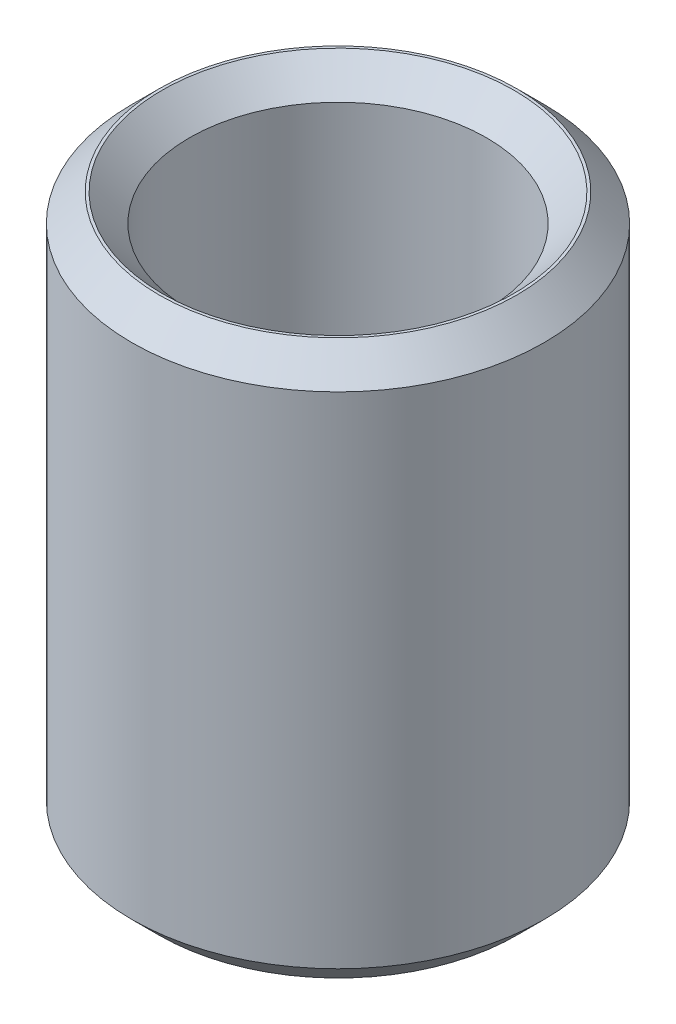
ISO-10303-21;
HEADER;
FILE_DESCRIPTION(('STEP AP214'),'2;1');
FILE_NAME('part.step','',(''),(''),'','','');
FILE_SCHEMA(('AUTOMOTIVE_DESIGN { 1 0 10303 214 1 1 1 1 }'));
ENDSEC;
DATA;
#1=APPLICATION_CONTEXT('core data for automotive mechanical design processes');
#2=APPLICATION_PROTOCOL_DEFINITION('international standard','automotive_design',2000,#1);
#3=PRODUCT_CONTEXT('',#1,'mechanical');
#4=PRODUCT('Part','Part','',(#3));
#5=PRODUCT_RELATED_PRODUCT_CATEGORY('part','',(#4));
#6=PRODUCT_DEFINITION_FORMATION('','',#4);
#7=PRODUCT_DEFINITION_CONTEXT('part definition',#1,'design');
#8=PRODUCT_DEFINITION('design','',#6,#7);
#9=PRODUCT_DEFINITION_SHAPE('','',#8);
#10=(LENGTH_UNIT() NAMED_UNIT(*) SI_UNIT(.MILLI.,.METRE.));
#11=(NAMED_UNIT(*) PLANE_ANGLE_UNIT() SI_UNIT($,.RADIAN.));
#12=(NAMED_UNIT(*) SI_UNIT($,.STERADIAN.) SOLID_ANGLE_UNIT());
#13=UNCERTAINTY_MEASURE_WITH_UNIT(LENGTH_MEASURE(1.E-05),#10,'distance_accuracy_value','');
#14=(GEOMETRIC_REPRESENTATION_CONTEXT(3) GLOBAL_UNCERTAINTY_ASSIGNED_CONTEXT((#13)) GLOBAL_UNIT_ASSIGNED_CONTEXT((#10,
#11,#12)) REPRESENTATION_CONTEXT('',''));
#15=CARTESIAN_POINT('',(0.,0.,0.));
#16=DIRECTION('',(0.,0.,1.));
#17=DIRECTION('',(1.,0.,0.));
#18=AXIS2_PLACEMENT_3D('',#15,#16,#17);
#19=CARTESIAN_POINT('',(0.,73.9349199069751,0.));
#20=DIRECTION('',(0.,-1.,0.));
#21=DIRECTION('',(0.,0.,-1.));
#22=AXIS2_PLACEMENT_3D('',#19,#20,#21);
#23=CYLINDRICAL_SURFACE('',#22,27.5);
#24=CARTESIAN_POINT('',(0.,3.65891610564793,0.));
#25=DIRECTION('',(0.,1.,0.));
#26=DIRECTION('',(0.,0.,1.));
#27=AXIS2_PLACEMENT_3D('',#24,#25,#26);
#28=CIRCLE('',#27,27.5);
#29=CARTESIAN_POINT('',(0.,3.65891610564793,-27.5));
#30=VERTEX_POINT('',#29);
#31=EDGE_CURVE('E10',#30,#30,#28,.T.);
#32=CARTESIAN_POINT('',(0.,70.2760038013273,0.));
#33=DIRECTION('',(0.,1.,0.));
#34=DIRECTION('',(0.,0.,1.));
#35=AXIS2_PLACEMENT_3D('',#32,#33,#34);
#36=CIRCLE('',#35,27.5);
#37=CARTESIAN_POINT('',(0.,70.2760038013273,-27.5));
#38=VERTEX_POINT('',#37);
#39=EDGE_CURVE('E50',#38,#38,#36,.F.);
#40=CARTESIAN_POINT('',(0.,3.65891610564793,-27.5));
#41=CARTESIAN_POINT('',(0.,4.35284410247793,-27.5));
#42=CARTESIAN_POINT('',(0.,5.04677209930792,-27.5));
#43=CARTESIAN_POINT('',(0.,6.43462809296791,-27.5));
#44=CARTESIAN_POINT('',(0.,7.1285560897979,-27.5));
#45=CARTESIAN_POINT('',(0.,8.51641208345788,-27.5));
#46=CARTESIAN_POINT('',(0.,9.21034008028788,-27.5));
#47=CARTESIAN_POINT('',(0.,10.5981960739479,-27.5));
#48=CARTESIAN_POINT('',(0.,11.2921240707779,-27.5));
#49=CARTESIAN_POINT('',(0.,12.6799800644378,-27.5));
#50=CARTESIAN_POINT('',(0.,13.3739080612678,-27.5));
#51=CARTESIAN_POINT('',(0.,14.7617640549278,-27.5));
#52=CARTESIAN_POINT('',(0.,15.4556920517578,-27.5));
#53=CARTESIAN_POINT('',(0.,16.8435480454178,-27.5));
#54=CARTESIAN_POINT('',(0.,17.5374760422478,-27.5));
#55=CARTESIAN_POINT('',(0.,18.9253320359078,-27.5));
#56=CARTESIAN_POINT('',(0.,19.6192600327378,-27.5));
#57=CARTESIAN_POINT('',(0.,21.0071160263978,-27.5));
#58=CARTESIAN_POINT('',(0.,21.7010440232277,-27.5));
#59=CARTESIAN_POINT('',(0.,23.0889000168877,-27.5));
#60=CARTESIAN_POINT('',(0.,23.7828280137177,-27.5));
#61=CARTESIAN_POINT('',(0.,25.1706840073777,-27.5));
#62=CARTESIAN_POINT('',(0.,25.8646120042077,-27.5));
#63=CARTESIAN_POINT('',(0.,27.2524679978677,-27.5));
#64=CARTESIAN_POINT('',(0.,27.9463959946977,-27.5));
#65=CARTESIAN_POINT('',(0.,29.3342519883577,-27.5));
#66=CARTESIAN_POINT('',(0.,30.0281799851877,-27.5));
#67=CARTESIAN_POINT('',(0.,31.4160359788477,-27.5));
#68=CARTESIAN_POINT('',(0.,32.1099639756777,-27.5));
#69=CARTESIAN_POINT('',(0.,33.4978199693376,-27.5));
#70=CARTESIAN_POINT('',(0.,34.1917479661676,-27.5));
#71=CARTESIAN_POINT('',(0.,35.5796039598276,-27.5));
#72=CARTESIAN_POINT('',(0.,36.2735319566576,-27.5));
#73=CARTESIAN_POINT('',(0.,37.6613879503176,-27.5));
#74=CARTESIAN_POINT('',(0.,38.3553159471476,-27.5));
#75=CARTESIAN_POINT('',(0.,39.7431719408076,-27.5));
#76=CARTESIAN_POINT('',(0.,40.4370999376376,-27.5));
#77=CARTESIAN_POINT('',(0.,41.8249559312976,-27.5));
#78=CARTESIAN_POINT('',(0.,42.5188839281276,-27.5));
#79=CARTESIAN_POINT('',(0.,43.9067399217875,-27.5));
#80=CARTESIAN_POINT('',(0.,44.6006679186175,-27.5));
#81=CARTESIAN_POINT('',(0.,45.9885239122775,-27.5));
#82=CARTESIAN_POINT('',(0.,46.6824519091075,-27.5));
#83=CARTESIAN_POINT('',(0.,48.0703079027675,-27.5));
#84=CARTESIAN_POINT('',(0.,48.7642358995975,-27.5));
#85=CARTESIAN_POINT('',(0.,50.1520918932575,-27.5));
#86=CARTESIAN_POINT('',(0.,50.8460198900875,-27.5));
#87=CARTESIAN_POINT('',(0.,52.2338758837475,-27.5));
#88=CARTESIAN_POINT('',(0.,52.9278038805774,-27.5));
#89=CARTESIAN_POINT('',(0.,54.3156598742374,-27.5));
#90=CARTESIAN_POINT('',(0.,55.0095878710674,-27.5));
#91=CARTESIAN_POINT('',(0.,56.3974438647274,-27.5));
#92=CARTESIAN_POINT('',(0.,57.0913718615574,-27.5));
#93=CARTESIAN_POINT('',(0.,58.4792278552174,-27.5));
#94=CARTESIAN_POINT('',(0.,59.1731558520474,-27.5));
#95=CARTESIAN_POINT('',(0.,60.5610118457074,-27.5));
#96=CARTESIAN_POINT('',(0.,61.2549398425374,-27.5));
#97=CARTESIAN_POINT('',(0.,62.6427958361974,-27.5));
#98=CARTESIAN_POINT('',(0.,63.3367238330273,-27.5));
#99=CARTESIAN_POINT('',(0.,64.7245798266873,-27.5));
#100=CARTESIAN_POINT('',(0.,65.4185078235173,-27.5));
#101=CARTESIAN_POINT('',(0.,66.8063638171773,-27.5));
#102=CARTESIAN_POINT('',(0.,67.5002918140073,-27.5));
#103=CARTESIAN_POINT('',(0.,68.8881478076673,-27.5));
#104=CARTESIAN_POINT('',(0.,69.5820758044973,-27.5));
#105=CARTESIAN_POINT('',(0.,70.2760038013273,-27.5));
#106=B_SPLINE_CURVE_WITH_KNOTS('',3,(#40,#41,#42,#43,#44,#45,#46,#47,#48,#49,#50,#51,#52,#53,
#54,#55,#56,#57,#58,#59,#60,#61,#62,#63,#64,#65,#66,#67,#68,#69,#70,#71,#72,#73,#74,#75,#76,#77,
#78,#79,#80,#81,#82,#83,#84,#85,#86,#87,#88,#89,#90,#91,#92,#93,#94,#95,#96,#97,#98,#99,#100,
#101,#102,#103,#104,#105),.UNSPECIFIED.,.F.,.F.,(4,2,2,2,2,2,2,2,2,2,2,2,2,2,2,2,2,2,2,2,2,2,2,
2,2,2,2,2,2,2,2,2,4),(0.,2.08178399048999,4.16356798097996,6.24535197146994,8.32713596195991,
10.4089199524499,12.4907039429399,14.5724879334298,16.6542719239198,18.7360559144098,
20.8178399048998,22.8996238953898,24.9814078858797,27.0631918763697,29.1449758668597,
31.2267598573497,33.3085438478397,35.3903278383296,37.4721118288196,39.5538958193096,
41.6356798097996,43.7174638002896,45.7992477907795,47.8810317812695,49.9628157717595,
52.0445997622495,54.1263837527395,56.2081677432294,58.2899517337194,60.3717357242094,
62.4535197146994,64.5353037051893,66.6170876956793),.UNSPECIFIED.);
#107=EDGE_CURVE('BSEAM39',#30,#38,#106,.T.);
#108=ORIENTED_EDGE('',*,*,#31,.T.);
#109=ORIENTED_EDGE('',*,*,#39,.T.);
#110=ORIENTED_EDGE('',*,*,#107,.T.);
#111=ORIENTED_EDGE('',*,*,#107,.F.);
#112=EDGE_LOOP('',(#108,#110,#109,#111));
#113=FACE_BOUND('',#112,.T.);
#114=ADVANCED_FACE('F39',(#113),#23,.T.);
#115=CARTESIAN_POINT('',(0.,73.9349199069751,0.));
#116=DIRECTION('',(0.,1.,0.));
#117=DIRECTION('',(0.,0.,1.));
#118=AXIS2_PLACEMENT_3D('',#115,#116,#117);
#119=PLANE('',#118);
#120=CARTESIAN_POINT('',(0.,73.9349199069751,0.));
#121=DIRECTION('',(0.,1.,0.));
#122=DIRECTION('',(0.,0.,1.));
#123=AXIS2_PLACEMENT_3D('',#120,#121,#122);
#124=CIRCLE('',#123,23.4745961594042);
#125=CARTESIAN_POINT('',(0.,73.9349199069751,23.4745961594042));
#126=VERTEX_POINT('',#125);
#127=EDGE_CURVE('E58',#126,#126,#124,.F.);
#128=ORIENTED_EDGE('',*,*,#127,.T.);
#129=EDGE_LOOP('',(#128));
#130=FACE_BOUND('',#129,.T.);
#131=CARTESIAN_POINT('',(0.,73.9349199069751,0.));
#132=DIRECTION('',(0.,1.,0.));
#133=DIRECTION('',(0.,0.,1.));
#134=AXIS2_PLACEMENT_3D('',#131,#132,#133);
#135=CIRCLE('',#134,23.8410838943522);
#136=CARTESIAN_POINT('',(0.,73.9349199069751,23.8410838943522));
#137=VERTEX_POINT('',#136);
#138=EDGE_CURVE('E61',#137,#137,#135,.T.);
#139=ORIENTED_EDGE('',*,*,#138,.T.);
#140=EDGE_LOOP('',(#139));
#141=FACE_BOUND('',#140,.T.);
#142=ADVANCED_FACE('F88',(#130,#141),#119,.T.);
#143=CARTESIAN_POINT('',(0.,0.,0.));
#144=DIRECTION('',(0.,1.,0.));
#145=DIRECTION('',(0.,0.,1.));
#146=AXIS2_PLACEMENT_3D('',#143,#144,#145);
#147=PLANE('',#146);
#148=CARTESIAN_POINT('',(0.,0.,0.));
#149=DIRECTION('',(0.,1.,0.));
#150=DIRECTION('',(0.,0.,1.));
#151=AXIS2_PLACEMENT_3D('',#148,#149,#150);
#152=CIRCLE('',#151,23.4745961594041);
#153=CARTESIAN_POINT('',(0.,0.,-23.4745961594041));
#154=VERTEX_POINT('',#153);
#155=EDGE_CURVE('E51',#154,#154,#152,.T.);
#156=ORIENTED_EDGE('',*,*,#155,.T.);
#157=EDGE_LOOP('',(#156));
#158=FACE_BOUND('',#157,.T.);
#159=CARTESIAN_POINT('',(0.,0.,0.));
#160=DIRECTION('',(0.,1.,0.));
#161=DIRECTION('',(0.,0.,1.));
#162=AXIS2_PLACEMENT_3D('',#159,#160,#161);
#163=CIRCLE('',#162,23.841083894352);
#164=CARTESIAN_POINT('',(0.,0.,23.841083894352));
#165=VERTEX_POINT('',#164);
#166=EDGE_CURVE('E54',#165,#165,#163,.F.);
#167=ORIENTED_EDGE('',*,*,#166,.T.);
#168=EDGE_LOOP('',(#167));
#169=FACE_BOUND('',#168,.T.);
#170=ADVANCED_FACE('F83',(#158,#169),#147,.F.);
#171=CARTESIAN_POINT('',(0.,73.9349199069751,0.));
#172=DIRECTION('',(0.,-1.,0.));
#173=DIRECTION('',(0.,0.,-1.));
#174=AXIS2_PLACEMENT_3D('',#171,#172,#173);
#175=CYLINDRICAL_SURFACE('',#174,19.8156800537563);
#176=CARTESIAN_POINT('',(0.,70.2760038013272,0.));
#177=DIRECTION('',(0.,1.,0.));
#178=DIRECTION('',(0.,0.,1.));
#179=AXIS2_PLACEMENT_3D('',#176,#177,#178);
#180=CIRCLE('',#179,19.8156800537563);
#181=CARTESIAN_POINT('',(0.,70.2760038013272,-19.8156800537563));
#182=VERTEX_POINT('',#181);
#183=EDGE_CURVE('E67',#182,#182,#180,.T.);
#184=CARTESIAN_POINT('',(0.,3.65891610564786,0.));
#185=DIRECTION('',(0.,1.,0.));
#186=DIRECTION('',(0.,0.,1.));
#187=AXIS2_PLACEMENT_3D('',#184,#185,#186);
#188=CIRCLE('',#187,19.8156800537563);
#189=CARTESIAN_POINT('',(0.,3.65891610564785,-19.8156800537563));
#190=VERTEX_POINT('',#189);
#191=EDGE_CURVE('E69',#190,#190,#188,.F.);
#192=CARTESIAN_POINT('',(0.,70.2760038013272,-19.8156800537563));
#193=CARTESIAN_POINT('',(0.,69.5820758044972,-19.8156800537563));
#194=CARTESIAN_POINT('',(0.,68.8881478076672,-19.8156800537563));
#195=CARTESIAN_POINT('',(0.,67.5002918140072,-19.8156800537563));
#196=CARTESIAN_POINT('',(0.,66.8063638171772,-19.8156800537563));
#197=CARTESIAN_POINT('',(0.,65.4185078235173,-19.8156800537563));
#198=CARTESIAN_POINT('',(0.,64.7245798266873,-19.8156800537563));
#199=CARTESIAN_POINT('',(0.,63.3367238330273,-19.8156800537563));
#200=CARTESIAN_POINT('',(0.,62.6427958361973,-19.8156800537563));
#201=CARTESIAN_POINT('',(0.,61.2549398425373,-19.8156800537563));
#202=CARTESIAN_POINT('',(0.,60.5610118457073,-19.8156800537563));
#203=CARTESIAN_POINT('',(0.,59.1731558520473,-19.8156800537563));
#204=CARTESIAN_POINT('',(0.,58.4792278552173,-19.8156800537563));
#205=CARTESIAN_POINT('',(0.,57.0913718615573,-19.8156800537563));
#206=CARTESIAN_POINT('',(0.,56.3974438647273,-19.8156800537563));
#207=CARTESIAN_POINT('',(0.,55.0095878710674,-19.8156800537563));
#208=CARTESIAN_POINT('',(0.,54.3156598742374,-19.8156800537563));
#209=CARTESIAN_POINT('',(0.,52.9278038805774,-19.8156800537563));
#210=CARTESIAN_POINT('',(0.,52.2338758837474,-19.8156800537563));
#211=CARTESIAN_POINT('',(0.,50.8460198900874,-19.8156800537563));
#212=CARTESIAN_POINT('',(0.,50.1520918932574,-19.8156800537563));
#213=CARTESIAN_POINT('',(0.,48.7642358995974,-19.8156800537563));
#214=CARTESIAN_POINT('',(0.,48.0703079027674,-19.8156800537563));
#215=CARTESIAN_POINT('',(0.,46.6824519091074,-19.8156800537563));
#216=CARTESIAN_POINT('',(0.,45.9885239122774,-19.8156800537563));
#217=CARTESIAN_POINT('',(0.,44.6006679186175,-19.8156800537563));
#218=CARTESIAN_POINT('',(0.,43.9067399217875,-19.8156800537563));
#219=CARTESIAN_POINT('',(0.,42.5188839281275,-19.8156800537563));
#220=CARTESIAN_POINT('',(0.,41.8249559312975,-19.8156800537563));
#221=CARTESIAN_POINT('',(0.,40.4370999376375,-19.8156800537563));
#222=CARTESIAN_POINT('',(0.,39.7431719408075,-19.8156800537563));
#223=CARTESIAN_POINT('',(0.,38.3553159471475,-19.8156800537563));
#224=CARTESIAN_POINT('',(0.,37.6613879503175,-19.8156800537563));
#225=CARTESIAN_POINT('',(0.,36.2735319566575,-19.8156800537563));
#226=CARTESIAN_POINT('',(0.,35.5796039598275,-19.8156800537563));
#227=CARTESIAN_POINT('',(0.,34.1917479661676,-19.8156800537563));
#228=CARTESIAN_POINT('',(0.,33.4978199693376,-19.8156800537563));
#229=CARTESIAN_POINT('',(0.,32.1099639756776,-19.8156800537563));
#230=CARTESIAN_POINT('',(0.,31.4160359788476,-19.8156800537563));
#231=CARTESIAN_POINT('',(0.,30.0281799851876,-19.8156800537563));
#232=CARTESIAN_POINT('',(0.,29.3342519883576,-19.8156800537563));
#233=CARTESIAN_POINT('',(0.,27.9463959946976,-19.8156800537563));
#234=CARTESIAN_POINT('',(0.,27.2524679978676,-19.8156800537563));
#235=CARTESIAN_POINT('',(0.,25.8646120042076,-19.8156800537563));
#236=CARTESIAN_POINT('',(0.,25.1706840073776,-19.8156800537563));
#237=CARTESIAN_POINT('',(0.,23.7828280137177,-19.8156800537563));
#238=CARTESIAN_POINT('',(0.,23.0889000168877,-19.8156800537563));
#239=CARTESIAN_POINT('',(0.,21.7010440232277,-19.8156800537563));
#240=CARTESIAN_POINT('',(0.,21.0071160263977,-19.8156800537563));
#241=CARTESIAN_POINT('',(0.,19.6192600327377,-19.8156800537563));
#242=CARTESIAN_POINT('',(0.,18.9253320359077,-19.8156800537563));
#243=CARTESIAN_POINT('',(0.,17.5374760422477,-19.8156800537563));
#244=CARTESIAN_POINT('',(0.,16.8435480454177,-19.8156800537563));
#245=CARTESIAN_POINT('',(0.,15.4556920517577,-19.8156800537563));
#246=CARTESIAN_POINT('',(0.,14.7617640549277,-19.8156800537563));
#247=CARTESIAN_POINT('',(0.,13.3739080612678,-19.8156800537563));
#248=CARTESIAN_POINT('',(0.,12.6799800644378,-19.8156800537563));
#249=CARTESIAN_POINT('',(0.,11.2921240707778,-19.8156800537563));
#250=CARTESIAN_POINT('',(0.,10.5981960739478,-19.8156800537563));
#251=CARTESIAN_POINT('',(0.,9.2103400802878,-19.8156800537563));
#252=CARTESIAN_POINT('',(0.,8.51641208345781,-19.8156800537563));
#253=CARTESIAN_POINT('',(0.,7.12855608979783,-19.8156800537563));
#254=CARTESIAN_POINT('',(0.,6.43462809296784,-19.8156800537563));
#255=CARTESIAN_POINT('',(0.,5.04677209930785,-19.8156800537563));
#256=CARTESIAN_POINT('',(0.,4.35284410247785,-19.8156800537563));
#257=CARTESIAN_POINT('',(0.,3.65891610564785,-19.8156800537563));
#258=B_SPLINE_CURVE_WITH_KNOTS('',3,(#192,#193,#194,#195,#196,#197,#198,#199,#200,#201,#202,
#203,#204,#205,#206,#207,#208,#209,#210,#211,#212,#213,#214,#215,#216,#217,#218,#219,#220,#221,
#222,#223,#224,#225,#226,#227,#228,#229,#230,#231,#232,#233,#234,#235,#236,#237,#238,#239,#240,
#241,#242,#243,#244,#245,#246,#247,#248,#249,#250,#251,#252,#253,#254,#255,#256,#257),
.UNSPECIFIED.,.F.,.F.,(4,2,2,2,2,2,2,2,2,2,2,2,2,2,2,2,2,2,2,2,2,2,2,2,2,2,2,2,2,2,2,2,4),(0.,
2.08178399048999,4.16356798097997,6.24535197146994,8.32713596195993,10.4089199524499,
12.4907039429399,14.5724879334299,16.6542719239198,18.7360559144098,20.8178399048998,
22.8996238953898,24.9814078858798,27.0631918763697,29.1449758668597,31.2267598573497,
33.3085438478397,35.3903278383297,37.4721118288196,39.5538958193096,41.6356798097996,
43.7174638002896,45.7992477907796,47.8810317812695,49.9628157717595,52.0445997622495,
54.1263837527395,56.2081677432295,58.2899517337194,60.3717357242094,62.4535197146994,
64.5353037051894,66.6170876956794),.UNSPECIFIED.);
#259=EDGE_CURVE('BSEAM71',#182,#190,#258,.T.);
#260=ORIENTED_EDGE('',*,*,#183,.T.);
#261=ORIENTED_EDGE('',*,*,#191,.T.);
#262=ORIENTED_EDGE('',*,*,#259,.T.);
#263=ORIENTED_EDGE('',*,*,#259,.F.);
#264=EDGE_LOOP('',(#260,#262,#261,#263));
#265=FACE_BOUND('',#264,.T.);
#266=ADVANCED_FACE('F71',(#265),#175,.F.);
#267=CARTESIAN_POINT('',(0.,70.2760038013272,0.));
#268=DIRECTION('',(0.,1.,0.));
#269=DIRECTION('',(0.,0.,1.));
#270=AXIS2_PLACEMENT_3D('',#267,#268,#269);
#271=CONICAL_SURFACE('',#270,19.8156800537563,0.785398163397453);
#272=ORIENTED_EDGE('',*,*,#127,.F.);
#273=EDGE_LOOP('',(#272));
#274=FACE_BOUND('',#273,.T.);
#275=ORIENTED_EDGE('',*,*,#183,.F.);
#276=EDGE_LOOP('',(#275));
#277=FACE_BOUND('',#276,.T.);
#278=ADVANCED_FACE('F77',(#274,#277),#271,.F.);
#279=CARTESIAN_POINT('',(0.,0.,0.));
#280=DIRECTION('',(0.,-1.,0.));
#281=DIRECTION('',(0.,0.,-1.));
#282=AXIS2_PLACEMENT_3D('',#279,#280,#281);
#283=CONICAL_SURFACE('',#282,23.4745961594041,0.785398163397444);
#284=CARTESIAN_POINT('',(0.,3.65891610564786,-19.8156800537563));
#285=CARTESIAN_POINT('',(0.,3.62080239621403,-19.8537937631901));
#286=CARTESIAN_POINT('',(0.,3.5826886867802,-19.8919074726239));
#287=CARTESIAN_POINT('',(0.,3.50646126791254,-19.9681348914916));
#288=CARTESIAN_POINT('',(0.,3.4683475584787,-20.0062486009254));
#289=CARTESIAN_POINT('',(0.,3.39212013961104,-20.0824760197931));
#290=CARTESIAN_POINT('',(0.,3.35400643017721,-20.1205897292269));
#291=CARTESIAN_POINT('',(0.,3.27777901130954,-20.1968171480946));
#292=CARTESIAN_POINT('',(0.,3.23966530187571,-20.2349308575284));
#293=CARTESIAN_POINT('',(0.,3.16343788300805,-20.3111582763961));
#294=CARTESIAN_POINT('',(0.,3.12532417357422,-20.3492719858299));
#295=CARTESIAN_POINT('',(0.,3.04909675470655,-20.4254994046976));
#296=CARTESIAN_POINT('',(0.,3.01098304527272,-20.4636131141314));
#297=CARTESIAN_POINT('',(0.,2.93475562640506,-20.5398405329991));
#298=CARTESIAN_POINT('',(0.,2.89664191697123,-20.5779542424329));
#299=CARTESIAN_POINT('',(0.,2.82041449810356,-20.6541816613006));
#300=CARTESIAN_POINT('',(0.,2.78230078866973,-20.6922953707344));
#301=CARTESIAN_POINT('',(0.,2.70607336980206,-20.7685227896021));
#302=CARTESIAN_POINT('',(0.,2.66795966036823,-20.8066364990359));
#303=CARTESIAN_POINT('',(0.,2.59173224150057,-20.8828639179036));
#304=CARTESIAN_POINT('',(0.,2.55361853206674,-20.9209776273374));
#305=CARTESIAN_POINT('',(0.,2.47739111319907,-20.9972050462051));
#306=CARTESIAN_POINT('',(0.,2.43927740376524,-21.0353187556389));
#307=CARTESIAN_POINT('',(0.,2.36304998489758,-21.1115461745066));
#308=CARTESIAN_POINT('',(0.,2.32493627546375,-21.1496598839404));
#309=CARTESIAN_POINT('',(0.,2.24870885659608,-21.225887302808));
#310=CARTESIAN_POINT('',(0.,2.21059514716225,-21.2640010122419));
#311=CARTESIAN_POINT('',(0.,2.13436772829459,-21.3402284311095));
#312=CARTESIAN_POINT('',(0.,2.09625401886075,-21.3783421405434));
#313=CARTESIAN_POINT('',(0.,2.02002659999309,-21.454569559411));
#314=CARTESIAN_POINT('',(0.,1.98191289055926,-21.4926832688449));
#315=CARTESIAN_POINT('',(0.,1.9056854716916,-21.5689106877125));
#316=CARTESIAN_POINT('',(0.,1.86757176225776,-21.6070243971464));
#317=CARTESIAN_POINT('',(0.,1.7913443433901,-21.683251816014));
#318=CARTESIAN_POINT('',(0.,1.75323063395627,-21.7213655254479));
#319=CARTESIAN_POINT('',(0.,1.6770032150886,-21.7975929443155));
#320=CARTESIAN_POINT('',(0.,1.63888950565477,-21.8357066537494));
#321=CARTESIAN_POINT('',(0.,1.56266208678711,-21.911934072617));
#322=CARTESIAN_POINT('',(0.,1.52454837735328,-21.9500477820509));
#323=CARTESIAN_POINT('',(0.,1.44832095848561,-22.0262752009185));
#324=CARTESIAN_POINT('',(0.,1.41020724905178,-22.0643889103523));
#325=CARTESIAN_POINT('',(0.,1.33397983018412,-22.14061632922));
#326=CARTESIAN_POINT('',(0.,1.29586612075028,-22.1787300386538));
#327=CARTESIAN_POINT('',(0.,1.21963870188262,-22.2549574575215));
#328=CARTESIAN_POINT('',(0.,1.18152499244879,-22.2930711669553));
#329=CARTESIAN_POINT('',(0.,1.10529757358113,-22.369298585823));
#330=CARTESIAN_POINT('',(0.,1.06718386414729,-22.4074122952568));
#331=CARTESIAN_POINT('',(0.,0.99095644527963,-22.4836397141245));
#332=CARTESIAN_POINT('',(0.,0.952842735845798,-22.5217534235583));
#333=CARTESIAN_POINT('',(0.,0.876615316978134,-22.597980842426));
#334=CARTESIAN_POINT('',(0.,0.838501607544302,-22.6360945518598));
#335=CARTESIAN_POINT('',(0.,0.762274188676638,-22.7123219707275));
#336=CARTESIAN_POINT('',(0.,0.724160479242806,-22.7504356801613));
#337=CARTESIAN_POINT('',(0.,0.647933060375143,-22.826663099029));
#338=CARTESIAN_POINT('',(0.,0.60981935094131,-22.8647768084628));
#339=CARTESIAN_POINT('',(0.,0.533591932073647,-22.9410042273305));
#340=CARTESIAN_POINT('',(0.,0.495478222639815,-22.9791179367643));
#341=CARTESIAN_POINT('',(0.,0.419250803772151,-23.055345355632));
#342=CARTESIAN_POINT('',(0.,0.381137094338319,-23.0934590650658));
#343=CARTESIAN_POINT('',(0.,0.304909675470655,-23.1696864839335));
#344=CARTESIAN_POINT('',(0.,0.266795966036823,-23.2078001933673));
#345=CARTESIAN_POINT('',(0.,0.19056854716916,-23.284027612235));
#346=CARTESIAN_POINT('',(0.,0.152454837735328,-23.3221413216688));
#347=CARTESIAN_POINT('',(0.,0.0762274188676638,-23.3983687405364));
#348=CARTESIAN_POINT('',(0.,0.0381137094338319,-23.4364824499703));
#349=CARTESIAN_POINT('',(0.,0.,-23.4745961594041));
#350=B_SPLINE_CURVE_WITH_KNOTS('',3,(#284,#285,#286,#287,#288,#289,#290,#291,#292,#293,#294,
#295,#296,#297,#298,#299,#300,#301,#302,#303,#304,#305,#306,#307,#308,#309,#310,#311,#312,#313,
#314,#315,#316,#317,#318,#319,#320,#321,#322,#323,#324,#325,#326,#327,#328,#329,#330,#331,#332,
#333,#334,#335,#336,#337,#338,#339,#340,#341,#342,#343,#344,#345,#346,#347,#348,#349),
.UNSPECIFIED.,.F.,.F.,(4,2,2,2,2,2,2,2,2,2,2,2,2,2,2,2,2,2,2,2,2,2,2,2,2,2,2,2,2,2,2,2,4),(0.,
0.161702774381017,0.323405548762034,0.48510832314305,0.646811097524067,0.808513871905084,
0.970216646286101,1.13191942066712,1.29362219504813,1.45532496942915,1.61702774381017,
1.77873051819118,1.9404332925722,2.10213606695322,2.26383884133423,2.42554161571525,
2.58724439009627,2.74894716447728,2.9106499388583,3.07235271323932,3.23405548762033,
3.39575826200135,3.55746103638237,3.71916381076338,3.8808665851444,4.04256935952542,
4.20427213390643,4.36597490828745,4.52767768266847,4.68938045704948,4.8510832314305,
5.01278600581151,5.17448878019253),.UNSPECIFIED.);
#351=EDGE_CURVE('BSEAM73',#190,#154,#350,.T.);
#352=ORIENTED_EDGE('',*,*,#191,.F.);
#353=ORIENTED_EDGE('',*,*,#155,.F.);
#354=ORIENTED_EDGE('',*,*,#351,.T.);
#355=ORIENTED_EDGE('',*,*,#351,.F.);
#356=EDGE_LOOP('',(#352,#354,#353,#355));
#357=FACE_BOUND('',#356,.T.);
#358=ADVANCED_FACE('F73',(#357),#283,.F.);
#359=CARTESIAN_POINT('',(0.,3.65891610564793,0.));
#360=DIRECTION('',(0.,1.,0.));
#361=DIRECTION('',(0.,0.,1.));
#362=AXIS2_PLACEMENT_3D('',#359,#360,#361);
#363=CONICAL_SURFACE('',#362,27.5,0.785398163397451);
#364=ORIENTED_EDGE('',*,*,#166,.F.);
#365=EDGE_LOOP('',(#364));
#366=FACE_BOUND('',#365,.T.);
#367=ORIENTED_EDGE('',*,*,#31,.F.);
#368=EDGE_LOOP('',(#367));
#369=FACE_BOUND('',#368,.T.);
#370=ADVANCED_FACE('F76',(#366,#369),#363,.T.);
#371=CARTESIAN_POINT('',(0.,73.9349199069751,0.));
#372=DIRECTION('',(0.,-1.,0.));
#373=DIRECTION('',(0.,0.,-1.));
#374=AXIS2_PLACEMENT_3D('',#371,#372,#373);
#375=CONICAL_SURFACE('',#374,23.8410838943522,0.785398163397444);
#376=ORIENTED_EDGE('',*,*,#39,.F.);
#377=EDGE_LOOP('',(#376));
#378=FACE_BOUND('',#377,.T.);
#379=ORIENTED_EDGE('',*,*,#138,.F.);
#380=EDGE_LOOP('',(#379));
#381=FACE_BOUND('',#380,.T.);
#382=ADVANCED_FACE('F45',(#378,#381),#375,.T.);
#383=CLOSED_SHELL('',(#114,#142,#170,#266,#278,#358,#370,#382));
#384=MANIFOLD_SOLID_BREP('B2',#383);
#385=ADVANCED_BREP_SHAPE_REPRESENTATION('',(#18,#384),#14);
#386=SHAPE_DEFINITION_REPRESENTATION(#9,#385);
ENDSEC;
END-ISO-10303-21;
